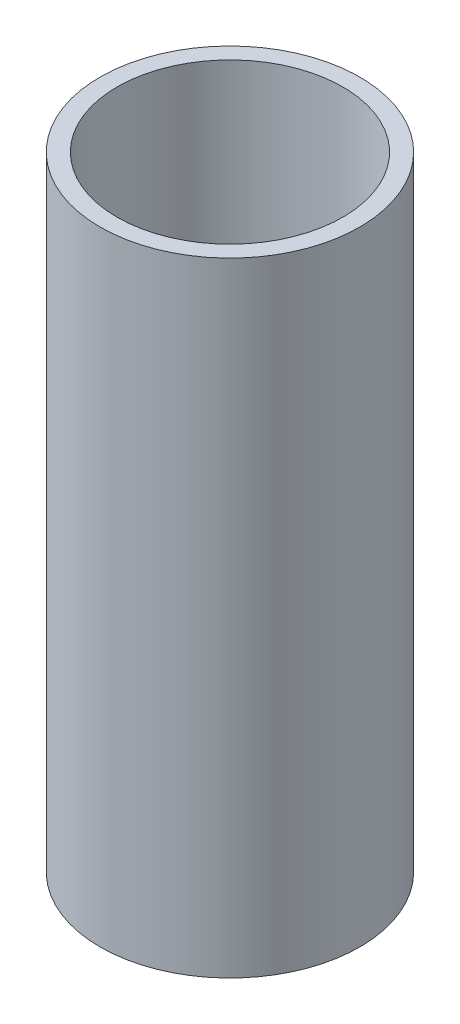
ISO-10303-21;
HEADER;
FILE_DESCRIPTION(('STEP AP214'),'2;1');
FILE_NAME('part.step','',(''),(''),'','','');
FILE_SCHEMA(('AUTOMOTIVE_DESIGN { 1 0 10303 214 1 1 1 1 }'));
ENDSEC;
DATA;
#1=APPLICATION_CONTEXT('core data for automotive mechanical design processes');
#2=APPLICATION_PROTOCOL_DEFINITION('international standard','automotive_design',2000,#1);
#3=PRODUCT_CONTEXT('',#1,'mechanical');
#4=PRODUCT('Part','Part','',(#3));
#5=PRODUCT_RELATED_PRODUCT_CATEGORY('part','',(#4));
#6=PRODUCT_DEFINITION_FORMATION('','',#4);
#7=PRODUCT_DEFINITION_CONTEXT('part definition',#1,'design');
#8=PRODUCT_DEFINITION('design','',#6,#7);
#9=PRODUCT_DEFINITION_SHAPE('','',#8);
#10=(LENGTH_UNIT() NAMED_UNIT(*) SI_UNIT(.MILLI.,.METRE.));
#11=(NAMED_UNIT(*) PLANE_ANGLE_UNIT() SI_UNIT($,.RADIAN.));
#12=(NAMED_UNIT(*) SI_UNIT($,.STERADIAN.) SOLID_ANGLE_UNIT());
#13=UNCERTAINTY_MEASURE_WITH_UNIT(LENGTH_MEASURE(1.E-05),#10,'distance_accuracy_value','');
#14=(GEOMETRIC_REPRESENTATION_CONTEXT(3) GLOBAL_UNCERTAINTY_ASSIGNED_CONTEXT((#13)) GLOBAL_UNIT_ASSIGNED_CONTEXT((#10,
#11,#12)) REPRESENTATION_CONTEXT('',''));
#15=CARTESIAN_POINT('',(0.,0.,0.));
#16=DIRECTION('',(0.,0.,1.));
#17=DIRECTION('',(1.,0.,0.));
#18=AXIS2_PLACEMENT_3D('',#15,#16,#17);
#19=CARTESIAN_POINT('',(0.,137.16,0.));
#20=DIRECTION('',(0.,-1.,0.));
#21=DIRECTION('',(0.,0.,-1.));
#22=AXIS2_PLACEMENT_3D('',#19,#20,#21);
#23=CYLINDRICAL_SURFACE('',#22,28.575);
#24=CARTESIAN_POINT('',(0.,137.16,0.));
#25=DIRECTION('',(0.,1.,0.));
#26=DIRECTION('',(0.,0.,1.));
#27=AXIS2_PLACEMENT_3D('',#24,#25,#26);
#28=CIRCLE('',#27,28.575);
#29=CARTESIAN_POINT('',(0.,137.16,28.575));
#30=VERTEX_POINT('',#29);
#31=EDGE_CURVE('E10',#30,#30,#28,.T.);
#32=ORIENTED_EDGE('',*,*,#31,.F.);
#33=EDGE_LOOP('',(#32));
#34=FACE_BOUND('',#33,.T.);
#35=CARTESIAN_POINT('',(0.,0.,0.));
#36=DIRECTION('',(0.,1.,0.));
#37=DIRECTION('',(0.,0.,1.));
#38=AXIS2_PLACEMENT_3D('',#35,#36,#37);
#39=CIRCLE('',#38,28.575);
#40=CARTESIAN_POINT('',(0.,0.,28.575));
#41=VERTEX_POINT('',#40);
#42=EDGE_CURVE('E38',#41,#41,#39,.T.);
#43=ORIENTED_EDGE('',*,*,#42,.T.);
#44=EDGE_LOOP('',(#43));
#45=FACE_BOUND('',#44,.T.);
#46=ADVANCED_FACE('F35',(#34,#45),#23,.T.);
#47=CARTESIAN_POINT('',(0.,137.16,0.));
#48=DIRECTION('',(0.,1.,0.));
#49=DIRECTION('',(0.,0.,1.));
#50=AXIS2_PLACEMENT_3D('',#47,#48,#49);
#51=PLANE('',#50);
#52=CARTESIAN_POINT('',(0.,137.16,0.));
#53=DIRECTION('',(0.,1.,0.));
#54=DIRECTION('',(0.,0.,1.));
#55=AXIS2_PLACEMENT_3D('',#52,#53,#54);
#56=CIRCLE('',#55,24.8292674287011);
#57=CARTESIAN_POINT('',(0.,137.16,24.8292674287011));
#58=VERTEX_POINT('',#57);
#59=EDGE_CURVE('E47',#58,#58,#56,.T.);
#60=ORIENTED_EDGE('',*,*,#59,.F.);
#61=EDGE_LOOP('',(#60));
#62=FACE_BOUND('',#61,.T.);
#63=ORIENTED_EDGE('',*,*,#31,.T.);
#64=EDGE_LOOP('',(#63));
#65=FACE_BOUND('',#64,.T.);
#66=ADVANCED_FACE('F72',(#62,#65),#51,.T.);
#67=CARTESIAN_POINT('',(0.,0.,0.));
#68=DIRECTION('',(0.,1.,0.));
#69=DIRECTION('',(0.,0.,1.));
#70=AXIS2_PLACEMENT_3D('',#67,#68,#69);
#71=PLANE('',#70);
#72=CARTESIAN_POINT('',(0.,0.,0.));
#73=DIRECTION('',(0.,-1.,0.));
#74=DIRECTION('',(0.,0.,-1.));
#75=AXIS2_PLACEMENT_3D('',#72,#73,#74);
#76=CIRCLE('',#75,20.);
#77=CARTESIAN_POINT('',(0.,0.,-20.));
#78=VERTEX_POINT('',#77);
#79=EDGE_CURVE('E53',#78,#78,#76,.T.);
#80=ORIENTED_EDGE('',*,*,#79,.F.);
#81=EDGE_LOOP('',(#80));
#82=FACE_BOUND('',#81,.T.);
#83=ORIENTED_EDGE('',*,*,#42,.F.);
#84=EDGE_LOOP('',(#83));
#85=FACE_BOUND('',#84,.T.);
#86=ADVANCED_FACE('F68',(#82,#85),#71,.F.);
#87=CARTESIAN_POINT('',(0.,60.96,0.));
#88=DIRECTION('',(0.,1.,0.));
#89=DIRECTION('',(0.,0.,1.));
#90=AXIS2_PLACEMENT_3D('',#87,#88,#89);
#91=CYLINDRICAL_SURFACE('',#90,24.8292674287011);
#92=CARTESIAN_POINT('',(0.,60.96,0.));
#93=DIRECTION('',(0.,1.,0.));
#94=DIRECTION('',(0.,0.,1.));
#95=AXIS2_PLACEMENT_3D('',#92,#93,#94);
#96=CIRCLE('',#95,24.8292674287011);
#97=CARTESIAN_POINT('',(0.,60.96,24.8292674287011));
#98=VERTEX_POINT('',#97);
#99=EDGE_CURVE('E45',#98,#98,#96,.T.);
#100=ORIENTED_EDGE('',*,*,#99,.F.);
#101=EDGE_LOOP('',(#100));
#102=FACE_BOUND('',#101,.T.);
#103=ORIENTED_EDGE('',*,*,#59,.T.);
#104=EDGE_LOOP('',(#103));
#105=FACE_BOUND('',#104,.T.);
#106=ADVANCED_FACE('F71',(#102,#105),#91,.F.);
#107=CARTESIAN_POINT('',(0.,60.96,0.));
#108=DIRECTION('',(0.,1.,0.));
#109=DIRECTION('',(0.,0.,1.));
#110=AXIS2_PLACEMENT_3D('',#107,#108,#109);
#111=PLANE('',#110);
#112=ORIENTED_EDGE('',*,*,#99,.T.);
#113=EDGE_LOOP('',(#112));
#114=FACE_BOUND('',#113,.T.);
#115=ADVANCED_FACE('F64',(#114),#111,.T.);
#116=CARTESIAN_POINT('',(0.,20.,0.));
#117=DIRECTION('',(0.,-1.,0.));
#118=DIRECTION('',(0.,0.,-1.));
#119=AXIS2_PLACEMENT_3D('',#116,#117,#118);
#120=CYLINDRICAL_SURFACE('',#119,20.);
#121=CARTESIAN_POINT('',(0.,20.,0.));
#122=DIRECTION('',(0.,-1.,0.));
#123=DIRECTION('',(0.,0.,-1.));
#124=AXIS2_PLACEMENT_3D('',#121,#122,#123);
#125=CIRCLE('',#124,20.);
#126=CARTESIAN_POINT('',(0.,20.,-20.));
#127=VERTEX_POINT('',#126);
#128=EDGE_CURVE('E50',#127,#127,#125,.T.);
#129=ORIENTED_EDGE('',*,*,#128,.F.);
#130=EDGE_LOOP('',(#129));
#131=FACE_BOUND('',#130,.T.);
#132=ORIENTED_EDGE('',*,*,#79,.T.);
#133=EDGE_LOOP('',(#132));
#134=FACE_BOUND('',#133,.T.);
#135=ADVANCED_FACE('F61',(#131,#134),#120,.F.);
#136=CARTESIAN_POINT('',(0.,20.,0.));
#137=DIRECTION('',(0.,-1.,0.));
#138=DIRECTION('',(0.,0.,-1.));
#139=AXIS2_PLACEMENT_3D('',#136,#137,#138);
#140=PLANE('',#139);
#141=ORIENTED_EDGE('',*,*,#128,.T.);
#142=EDGE_LOOP('',(#141));
#143=FACE_BOUND('',#142,.T.);
#144=ADVANCED_FACE('F59',(#143),#140,.T.);
#145=CLOSED_SHELL('',(#46,#66,#86,#106,#115,#135,#144));
#146=MANIFOLD_SOLID_BREP('B2',#145);
#147=ADVANCED_BREP_SHAPE_REPRESENTATION('',(#18,#146),#14);
#148=SHAPE_DEFINITION_REPRESENTATION(#9,#147);
ENDSEC;
END-ISO-10303-21;
